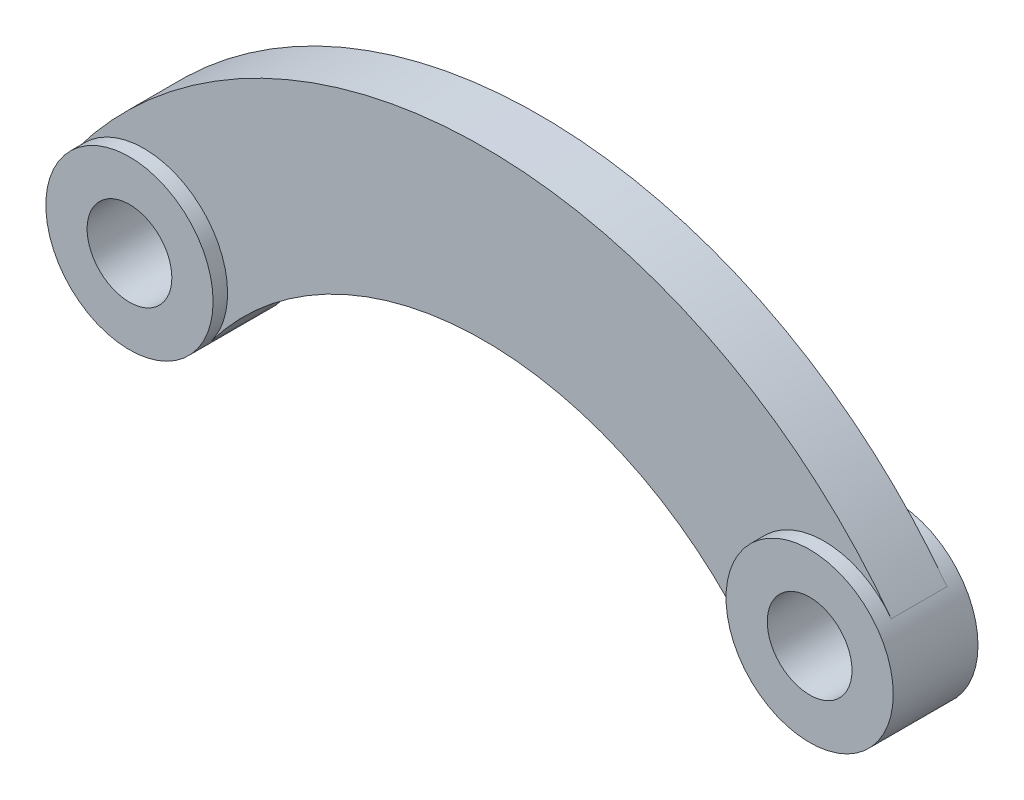
ISO-10303-21;
HEADER;
FILE_DESCRIPTION(('STEP AP214'),'2;1');
FILE_NAME('part.step','',(''),(''),'','','');
FILE_SCHEMA(('AUTOMOTIVE_DESIGN { 1 0 10303 214 1 1 1 1 }'));
ENDSEC;
DATA;
#1=APPLICATION_CONTEXT('core data for automotive mechanical design processes');
#2=APPLICATION_PROTOCOL_DEFINITION('international standard','automotive_design',2000,#1);
#3=PRODUCT_CONTEXT('',#1,'mechanical');
#4=PRODUCT('Part','Part','',(#3));
#5=PRODUCT_RELATED_PRODUCT_CATEGORY('part','',(#4));
#6=PRODUCT_DEFINITION_FORMATION('','',#4);
#7=PRODUCT_DEFINITION_CONTEXT('part definition',#1,'design');
#8=PRODUCT_DEFINITION('design','',#6,#7);
#9=PRODUCT_DEFINITION_SHAPE('','',#8);
#10=(LENGTH_UNIT() NAMED_UNIT(*) SI_UNIT(.MILLI.,.METRE.));
#11=(NAMED_UNIT(*) PLANE_ANGLE_UNIT() SI_UNIT($,.RADIAN.));
#12=(NAMED_UNIT(*) SI_UNIT($,.STERADIAN.) SOLID_ANGLE_UNIT());
#13=UNCERTAINTY_MEASURE_WITH_UNIT(LENGTH_MEASURE(1.E-05),#10,'distance_accuracy_value','');
#14=(GEOMETRIC_REPRESENTATION_CONTEXT(3) GLOBAL_UNCERTAINTY_ASSIGNED_CONTEXT((#13)) GLOBAL_UNIT_ASSIGNED_CONTEXT((#10,
#11,#12)) REPRESENTATION_CONTEXT('',''));
#15=CARTESIAN_POINT('',(0.,0.,0.));
#16=DIRECTION('',(0.,0.,1.));
#17=DIRECTION('',(1.,0.,0.));
#18=AXIS2_PLACEMENT_3D('',#15,#16,#17);
#19=CARTESIAN_POINT('',(-305.,0.,38.));
#20=DIRECTION('',(0.,0.,-1.));
#21=DIRECTION('',(-1.,0.,0.));
#22=AXIS2_PLACEMENT_3D('',#19,#20,#21);
#23=CYLINDRICAL_SURFACE('',#22,38.);
#24=CARTESIAN_POINT('',(-305.,0.,38.));
#25=DIRECTION('',(0.,0.,1.));
#26=DIRECTION('',(1.,0.,0.));
#27=AXIS2_PLACEMENT_3D('',#24,#25,#26);
#28=CIRCLE('',#27,38.);
#29=CARTESIAN_POINT('',(-267.,0.,38.));
#30=VERTEX_POINT('',#29);
#31=EDGE_CURVE('E41',#30,#30,#28,.T.);
#32=ORIENTED_EDGE('',*,*,#31,.T.);
#33=EDGE_LOOP('',(#32));
#34=FACE_BOUND('',#33,.T.);
#35=CARTESIAN_POINT('',(-305.,0.,-38.));
#36=DIRECTION('',(0.,0.,1.));
#37=DIRECTION('',(1.,0.,0.));
#38=AXIS2_PLACEMENT_3D('',#35,#36,#37);
#39=CIRCLE('',#38,38.);
#40=CARTESIAN_POINT('',(-267.,0.,-38.));
#41=VERTEX_POINT('',#40);
#42=EDGE_CURVE('E125',#41,#41,#39,.T.);
#43=ORIENTED_EDGE('',*,*,#42,.F.);
#44=EDGE_LOOP('',(#43));
#45=FACE_BOUND('',#44,.T.);
#46=ADVANCED_FACE('F33',(#34,#45),#23,.F.);
#47=CARTESIAN_POINT('',(-305.,0.,38.));
#48=DIRECTION('',(0.,0.,-1.));
#49=DIRECTION('',(-1.,0.,0.));
#50=AXIS2_PLACEMENT_3D('',#47,#48,#49);
#51=CYLINDRICAL_SURFACE('',#50,75.);
#52=DIRECTION('',(0.,0.,-1.));
#53=VECTOR('',#52,1.);
#54=CARTESIAN_POINT('',(-244.802631578947,-44.7356327235914,25.));
#55=LINE('',#54,#53);
#56=CARTESIAN_POINT('',(-244.802631578947,-44.7356327235914,25.));
#57=VERTEX_POINT('',#56);
#58=CARTESIAN_POINT('',(-244.802631578947,-44.7356327235914,-25.));
#59=VERTEX_POINT('',#58);
#60=EDGE_CURVE('E81',#57,#59,#55,.T.);
#61=ORIENTED_EDGE('',*,*,#60,.F.);
#62=CARTESIAN_POINT('',(-305.,0.,25.));
#63=DIRECTION('',(0.,0.,1.));
#64=DIRECTION('',(1.,0.,0.));
#65=AXIS2_PLACEMENT_3D('',#62,#63,#64);
#66=CIRCLE('',#65,75.);
#67=CARTESIAN_POINT('',(-365.197368421053,44.7356327235914,25.));
#68=VERTEX_POINT('',#67);
#69=EDGE_CURVE('E56',#57,#68,#66,.T.);
#70=ORIENTED_EDGE('',*,*,#69,.T.);
#71=DIRECTION('',(0.,0.,-1.));
#72=VECTOR('',#71,1.);
#73=CARTESIAN_POINT('',(-365.197368421053,44.7356327235914,25.));
#74=LINE('',#73,#72);
#75=CARTESIAN_POINT('',(-365.197368421053,44.7356327235914,-25.));
#76=VERTEX_POINT('',#75);
#77=EDGE_CURVE('E118',#68,#76,#74,.T.);
#78=ORIENTED_EDGE('',*,*,#77,.T.);
#79=CARTESIAN_POINT('',(-305.,0.,-25.));
#80=DIRECTION('',(0.,0.,1.));
#81=DIRECTION('',(1.,0.,0.));
#82=AXIS2_PLACEMENT_3D('',#79,#80,#81);
#83=CIRCLE('',#82,75.);
#84=EDGE_CURVE('E86',#59,#76,#83,.T.);
#85=ORIENTED_EDGE('',*,*,#84,.F.);
#86=EDGE_LOOP('',(#61,#70,#78,#85));
#87=FACE_BOUND('',#86,.T.);
#88=CARTESIAN_POINT('',(-305.,0.,38.));
#89=DIRECTION('',(0.,0.,1.));
#90=DIRECTION('',(1.,0.,0.));
#91=AXIS2_PLACEMENT_3D('',#88,#89,#90);
#92=CIRCLE('',#91,75.);
#93=CARTESIAN_POINT('',(-230.,0.,38.));
#94=VERTEX_POINT('',#93);
#95=EDGE_CURVE('E11',#94,#94,#92,.T.);
#96=ORIENTED_EDGE('',*,*,#95,.F.);
#97=EDGE_LOOP('',(#96));
#98=FACE_BOUND('',#97,.T.);
#99=CARTESIAN_POINT('',(-305.,0.,-38.));
#100=DIRECTION('',(0.,0.,1.));
#101=DIRECTION('',(1.,0.,0.));
#102=AXIS2_PLACEMENT_3D('',#99,#100,#101);
#103=CIRCLE('',#102,75.);
#104=CARTESIAN_POINT('',(-230.,0.,-38.));
#105=VERTEX_POINT('',#104);
#106=EDGE_CURVE('E36',#105,#105,#103,.T.);
#107=ORIENTED_EDGE('',*,*,#106,.T.);
#108=EDGE_LOOP('',(#107));
#109=FACE_BOUND('',#108,.T.);
#110=ADVANCED_FACE('F133',(#87,#98,#109),#51,.T.);
#111=CARTESIAN_POINT('',(0.,0.,38.));
#112=DIRECTION('',(0.,0.,1.));
#113=DIRECTION('',(1.,0.,0.));
#114=AXIS2_PLACEMENT_3D('',#111,#112,#113);
#115=PLANE('',#114);
#116=ORIENTED_EDGE('',*,*,#31,.F.);
#117=EDGE_LOOP('',(#116));
#118=FACE_BOUND('',#117,.T.);
#119=ORIENTED_EDGE('',*,*,#95,.T.);
#120=EDGE_LOOP('',(#119));
#121=FACE_BOUND('',#120,.T.);
#122=ADVANCED_FACE('F138',(#118,#121),#115,.T.);
#123=CARTESIAN_POINT('',(0.,0.,-38.));
#124=DIRECTION('',(0.,0.,1.));
#125=DIRECTION('',(1.,0.,0.));
#126=AXIS2_PLACEMENT_3D('',#123,#124,#125);
#127=PLANE('',#126);
#128=ORIENTED_EDGE('',*,*,#42,.T.);
#129=EDGE_LOOP('',(#128));
#130=FACE_BOUND('',#129,.T.);
#131=ORIENTED_EDGE('',*,*,#106,.F.);
#132=EDGE_LOOP('',(#131));
#133=FACE_BOUND('',#132,.T.);
#134=ADVANCED_FACE('F135',(#130,#133),#127,.F.);
#135=CARTESIAN_POINT('',(0.,-226.660539132863,25.));
#136=DIRECTION('',(0.,0.,-1.));
#137=DIRECTION('',(-1.,0.,0.));
#138=AXIS2_PLACEMENT_3D('',#135,#136,#137);
#139=CYLINDRICAL_SURFACE('',#138,455.);
#140=CARTESIAN_POINT('',(0.,-226.660539132863,-25.));
#141=DIRECTION('',(0.,0.,1.));
#142=DIRECTION('',(1.,0.,0.));
#143=AXIS2_PLACEMENT_3D('',#140,#141,#142);
#144=CIRCLE('',#143,455.);
#145=CARTESIAN_POINT('',(365.197368421053,44.7356327235913,-25.));
#146=VERTEX_POINT('',#145);
#147=EDGE_CURVE('E92',#76,#146,#144,.F.);
#148=ORIENTED_EDGE('',*,*,#147,.F.);
#149=ORIENTED_EDGE('',*,*,#77,.F.);
#150=CARTESIAN_POINT('',(0.,-226.660539132863,25.));
#151=DIRECTION('',(0.,0.,1.));
#152=DIRECTION('',(1.,0.,0.));
#153=AXIS2_PLACEMENT_3D('',#150,#151,#152);
#154=CIRCLE('',#153,455.);
#155=CARTESIAN_POINT('',(365.197368421053,44.7356327235912,25.));
#156=VERTEX_POINT('',#155);
#157=EDGE_CURVE('E114',#68,#156,#154,.F.);
#158=ORIENTED_EDGE('',*,*,#157,.T.);
#159=DIRECTION('',(0.,0.,-1.));
#160=VECTOR('',#159,1.);
#161=CARTESIAN_POINT('',(365.197368421053,44.7356327235913,25.));
#162=LINE('',#161,#160);
#163=EDGE_CURVE('E123',#156,#146,#162,.T.);
#164=ORIENTED_EDGE('',*,*,#163,.T.);
#165=EDGE_LOOP('',(#148,#149,#158,#164));
#166=FACE_BOUND('',#165,.T.);
#167=ADVANCED_FACE('F137',(#166),#139,.T.);
#168=CARTESIAN_POINT('',(0.,-226.660539132863,25.));
#169=DIRECTION('',(0.,0.,-1.));
#170=DIRECTION('',(-1.,0.,0.));
#171=AXIS2_PLACEMENT_3D('',#168,#169,#170);
#172=CYLINDRICAL_SURFACE('',#171,305.);
#173=CARTESIAN_POINT('',(0.,-226.660539132863,-25.));
#174=DIRECTION('',(0.,0.,1.));
#175=DIRECTION('',(1.,0.,0.));
#176=AXIS2_PLACEMENT_3D('',#173,#174,#175);
#177=CIRCLE('',#176,305.);
#178=CARTESIAN_POINT('',(244.802631578947,-44.7356327235914,-25.));
#179=VERTEX_POINT('',#178);
#180=EDGE_CURVE('E76',#179,#59,#177,.T.);
#181=ORIENTED_EDGE('',*,*,#180,.F.);
#182=DIRECTION('',(0.,0.,-1.));
#183=VECTOR('',#182,1.);
#184=CARTESIAN_POINT('',(244.802631578947,-44.7356327235914,25.));
#185=LINE('',#184,#183);
#186=CARTESIAN_POINT('',(244.802631578947,-44.7356327235915,25.));
#187=VERTEX_POINT('',#186);
#188=EDGE_CURVE('E80',#187,#179,#185,.T.);
#189=ORIENTED_EDGE('',*,*,#188,.F.);
#190=CARTESIAN_POINT('',(0.,-226.660539132863,25.));
#191=DIRECTION('',(0.,0.,1.));
#192=DIRECTION('',(1.,0.,0.));
#193=AXIS2_PLACEMENT_3D('',#190,#191,#192);
#194=CIRCLE('',#193,305.);
#195=EDGE_CURVE('E49',#187,#57,#194,.T.);
#196=ORIENTED_EDGE('',*,*,#195,.T.);
#197=ORIENTED_EDGE('',*,*,#60,.T.);
#198=EDGE_LOOP('',(#181,#189,#196,#197));
#199=FACE_BOUND('',#198,.T.);
#200=ADVANCED_FACE('F78',(#199),#172,.F.);
#201=CARTESIAN_POINT('',(0.,0.,25.));
#202=DIRECTION('',(0.,0.,1.));
#203=DIRECTION('',(1.,0.,0.));
#204=AXIS2_PLACEMENT_3D('',#201,#202,#203);
#205=PLANE('',#204);
#206=ORIENTED_EDGE('',*,*,#195,.F.);
#207=CARTESIAN_POINT('',(305.,0.,25.));
#208=DIRECTION('',(0.,0.,1.));
#209=DIRECTION('',(1.,0.,0.));
#210=AXIS2_PLACEMENT_3D('',#207,#208,#209);
#211=CIRCLE('',#210,75.);
#212=EDGE_CURVE('E85',#156,#187,#211,.T.);
#213=ORIENTED_EDGE('',*,*,#212,.F.);
#214=ORIENTED_EDGE('',*,*,#157,.F.);
#215=ORIENTED_EDGE('',*,*,#69,.F.);
#216=EDGE_LOOP('',(#206,#213,#214,#215));
#217=FACE_BOUND('',#216,.T.);
#218=ADVANCED_FACE('F161',(#217),#205,.T.);
#219=CARTESIAN_POINT('',(0.,0.,-25.));
#220=DIRECTION('',(0.,0.,1.));
#221=DIRECTION('',(1.,0.,0.));
#222=AXIS2_PLACEMENT_3D('',#219,#220,#221);
#223=PLANE('',#222);
#224=CARTESIAN_POINT('',(305.,0.,-25.));
#225=DIRECTION('',(0.,0.,1.));
#226=DIRECTION('',(1.,0.,0.));
#227=AXIS2_PLACEMENT_3D('',#224,#225,#226);
#228=CIRCLE('',#227,75.);
#229=EDGE_CURVE('E89',#146,#179,#228,.T.);
#230=ORIENTED_EDGE('',*,*,#229,.T.);
#231=ORIENTED_EDGE('',*,*,#180,.T.);
#232=ORIENTED_EDGE('',*,*,#84,.T.);
#233=ORIENTED_EDGE('',*,*,#147,.T.);
#234=EDGE_LOOP('',(#230,#231,#232,#233));
#235=FACE_BOUND('',#234,.T.);
#236=ADVANCED_FACE('F90',(#235),#223,.F.);
#237=CARTESIAN_POINT('',(305.,0.,38.));
#238=DIRECTION('',(0.,0.,-1.));
#239=DIRECTION('',(-1.,0.,0.));
#240=AXIS2_PLACEMENT_3D('',#237,#238,#239);
#241=CYLINDRICAL_SURFACE('',#240,75.);
#242=ORIENTED_EDGE('',*,*,#212,.T.);
#243=ORIENTED_EDGE('',*,*,#188,.T.);
#244=ORIENTED_EDGE('',*,*,#229,.F.);
#245=ORIENTED_EDGE('',*,*,#163,.F.);
#246=EDGE_LOOP('',(#242,#243,#244,#245));
#247=FACE_BOUND('',#246,.T.);
#248=CARTESIAN_POINT('',(305.,0.,38.));
#249=DIRECTION('',(0.,0.,1.));
#250=DIRECTION('',(1.,0.,0.));
#251=AXIS2_PLACEMENT_3D('',#248,#249,#250);
#252=CIRCLE('',#251,75.);
#253=CARTESIAN_POINT('',(380.,0.,38.));
#254=VERTEX_POINT('',#253);
#255=EDGE_CURVE('E103',#254,#254,#252,.T.);
#256=ORIENTED_EDGE('',*,*,#255,.F.);
#257=EDGE_LOOP('',(#256));
#258=FACE_BOUND('',#257,.T.);
#259=CARTESIAN_POINT('',(305.,0.,-38.));
#260=DIRECTION('',(0.,0.,1.));
#261=DIRECTION('',(1.,0.,0.));
#262=AXIS2_PLACEMENT_3D('',#259,#260,#261);
#263=CIRCLE('',#262,75.);
#264=CARTESIAN_POINT('',(380.,0.,-38.));
#265=VERTEX_POINT('',#264);
#266=EDGE_CURVE('E100',#265,#265,#263,.T.);
#267=ORIENTED_EDGE('',*,*,#266,.T.);
#268=EDGE_LOOP('',(#267));
#269=FACE_BOUND('',#268,.T.);
#270=ADVANCED_FACE('F97',(#247,#258,#269),#241,.T.);
#271=CARTESIAN_POINT('',(305.,0.,38.));
#272=DIRECTION('',(0.,0.,-1.));
#273=DIRECTION('',(-1.,0.,0.));
#274=AXIS2_PLACEMENT_3D('',#271,#272,#273);
#275=CYLINDRICAL_SURFACE('',#274,38.);
#276=CARTESIAN_POINT('',(305.,0.,38.));
#277=DIRECTION('',(0.,0.,1.));
#278=DIRECTION('',(1.,0.,0.));
#279=AXIS2_PLACEMENT_3D('',#276,#277,#278);
#280=CIRCLE('',#279,38.);
#281=CARTESIAN_POINT('',(343.,0.,38.));
#282=VERTEX_POINT('',#281);
#283=EDGE_CURVE('E95',#282,#282,#280,.T.);
#284=ORIENTED_EDGE('',*,*,#283,.T.);
#285=EDGE_LOOP('',(#284));
#286=FACE_BOUND('',#285,.T.);
#287=CARTESIAN_POINT('',(305.,0.,-38.));
#288=DIRECTION('',(0.,0.,1.));
#289=DIRECTION('',(1.,0.,0.));
#290=AXIS2_PLACEMENT_3D('',#287,#288,#289);
#291=CIRCLE('',#290,38.);
#292=CARTESIAN_POINT('',(343.,0.,-38.));
#293=VERTEX_POINT('',#292);
#294=EDGE_CURVE('E106',#293,#293,#291,.T.);
#295=ORIENTED_EDGE('',*,*,#294,.F.);
#296=EDGE_LOOP('',(#295));
#297=FACE_BOUND('',#296,.T.);
#298=ADVANCED_FACE('F173',(#286,#297),#275,.F.);
#299=CARTESIAN_POINT('',(0.,0.,38.));
#300=DIRECTION('',(0.,0.,1.));
#301=DIRECTION('',(1.,0.,0.));
#302=AXIS2_PLACEMENT_3D('',#299,#300,#301);
#303=PLANE('',#302);
#304=ORIENTED_EDGE('',*,*,#255,.T.);
#305=EDGE_LOOP('',(#304));
#306=FACE_BOUND('',#305,.T.);
#307=ORIENTED_EDGE('',*,*,#283,.F.);
#308=EDGE_LOOP('',(#307));
#309=FACE_BOUND('',#308,.T.);
#310=ADVANCED_FACE('F176',(#306,#309),#303,.T.);
#311=CARTESIAN_POINT('',(0.,0.,-38.));
#312=DIRECTION('',(0.,0.,1.));
#313=DIRECTION('',(1.,0.,0.));
#314=AXIS2_PLACEMENT_3D('',#311,#312,#313);
#315=PLANE('',#314);
#316=ORIENTED_EDGE('',*,*,#266,.F.);
#317=EDGE_LOOP('',(#316));
#318=FACE_BOUND('',#317,.T.);
#319=ORIENTED_EDGE('',*,*,#294,.T.);
#320=EDGE_LOOP('',(#319));
#321=FACE_BOUND('',#320,.T.);
#322=ADVANCED_FACE('F178',(#318,#321),#315,.F.);
#323=CLOSED_SHELL('',(#46,#110,#122,#134,#167,#200,#218,#236,#270,#298,#310,#322));
#324=MANIFOLD_SOLID_BREP('B2',#323);
#325=ADVANCED_BREP_SHAPE_REPRESENTATION('',(#18,#324),#14);
#326=SHAPE_DEFINITION_REPRESENTATION(#9,#325);
ENDSEC;
END-ISO-10303-21;
